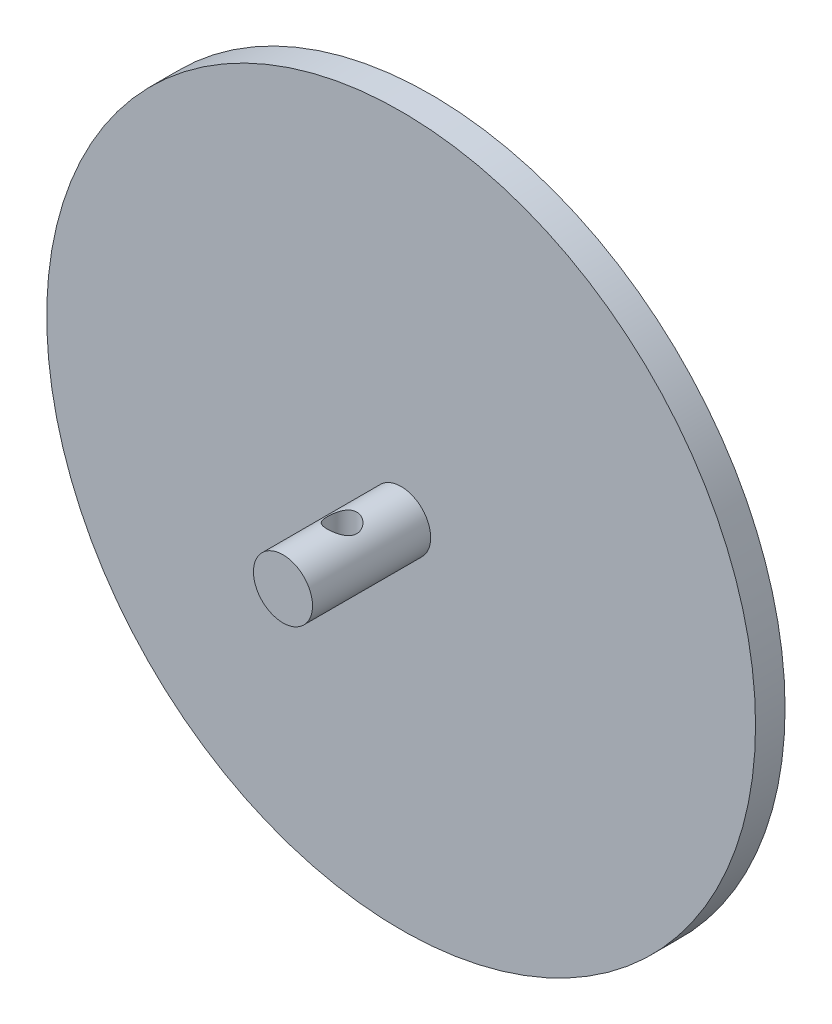
ISO-10303-21;
HEADER;
FILE_DESCRIPTION(('STEP AP214'),'2;1');
FILE_NAME('part.step','',(''),(''),'','','');
FILE_SCHEMA(('AUTOMOTIVE_DESIGN { 1 0 10303 214 1 1 1 1 }'));
ENDSEC;
DATA;
#1=APPLICATION_CONTEXT('core data for automotive mechanical design processes');
#2=APPLICATION_PROTOCOL_DEFINITION('international standard','automotive_design',2000,#1);
#3=PRODUCT_CONTEXT('',#1,'mechanical');
#4=PRODUCT('Part','Part','',(#3));
#5=PRODUCT_RELATED_PRODUCT_CATEGORY('part','',(#4));
#6=PRODUCT_DEFINITION_FORMATION('','',#4);
#7=PRODUCT_DEFINITION_CONTEXT('part definition',#1,'design');
#8=PRODUCT_DEFINITION('design','',#6,#7);
#9=PRODUCT_DEFINITION_SHAPE('','',#8);
#10=(LENGTH_UNIT() NAMED_UNIT(*) SI_UNIT(.MILLI.,.METRE.));
#11=(NAMED_UNIT(*) PLANE_ANGLE_UNIT() SI_UNIT($,.RADIAN.));
#12=(NAMED_UNIT(*) SI_UNIT($,.STERADIAN.) SOLID_ANGLE_UNIT());
#13=UNCERTAINTY_MEASURE_WITH_UNIT(LENGTH_MEASURE(1.E-05),#10,'distance_accuracy_value','');
#14=(GEOMETRIC_REPRESENTATION_CONTEXT(3) GLOBAL_UNCERTAINTY_ASSIGNED_CONTEXT((#13)) GLOBAL_UNIT_ASSIGNED_CONTEXT((#10,
#11,#12)) REPRESENTATION_CONTEXT('',''));
#15=CARTESIAN_POINT('',(0.,0.,0.));
#16=DIRECTION('',(0.,0.,1.));
#17=DIRECTION('',(1.,0.,0.));
#18=AXIS2_PLACEMENT_3D('',#15,#16,#17);
#19=CARTESIAN_POINT('',(0.,0.,25.4));
#20=DIRECTION('',(0.,0.,-1.));
#21=DIRECTION('',(-1.,0.,0.));
#22=AXIS2_PLACEMENT_3D('',#19,#20,#21);
#23=CYLINDRICAL_SURFACE('',#22,6.35);
#24=CARTESIAN_POINT('',(0.,-6.35,15.875));
#25=CARTESIAN_POINT('',(0.0834969220594999,-6.34999931166444,15.8749991122824));
#26=CARTESIAN_POINT('',(0.167002655580042,-6.34834758911701,15.871700125554));
#27=CARTESIAN_POINT('',(0.333378330258781,-6.34179105821715,15.8585541254501));
#28=CARTESIAN_POINT('',(0.416247978955772,-6.33688483467113,15.8487042634742));
#29=CARTESIAN_POINT('',(0.66318203064701,-6.31742426748325,15.809427934954));
#30=CARTESIAN_POINT('',(0.825450146761554,-6.29812827299425,15.7702749225986));
#31=CARTESIAN_POINT('',(1.13965128900426,-6.2489182313574,15.6680092887059));
#32=CARTESIAN_POINT('',(1.29162180811868,-6.21904547786825,15.6049897807566));
#33=CARTESIAN_POINT('',(1.58264035037879,-6.15142812041637,15.4572639263711));
#34=CARTESIAN_POINT('',(1.72168939123018,-6.11368413715877,15.372559289849));
#35=CARTESIAN_POINT('',(1.99234108848171,-6.03111096182982,15.1780303702658));
#36=CARTESIAN_POINT('',(2.12298433900092,-5.98599127270818,15.0669964222061));
#37=CARTESIAN_POINT('',(2.36467069069854,-5.89470535591056,14.8256033164272));
#38=CARTESIAN_POINT('',(2.47569885601321,-5.84853836069043,14.6952295702336));
#39=CARTESIAN_POINT('',(2.68368848497886,-5.75623634934464,14.4065790522467));
#40=CARTESIAN_POINT('',(2.77889135161934,-5.71038146176788,14.2469224686984));
#41=CARTESIAN_POINT('',(2.90019349951534,-5.64919759286363,13.9954520128256));
#42=CARTESIAN_POINT('',(2.93705266116892,-5.63006420805933,13.9095999381713));
#43=CARTESIAN_POINT('',(3.00322508739606,-5.59504604853267,13.7344143862936));
#44=CARTESIAN_POINT('',(3.03254280972159,-5.57915935583429,13.6450830018194));
#45=CARTESIAN_POINT('',(3.08174263292982,-5.55212611635049,13.4689894480353));
#46=CARTESIAN_POINT('',(3.10208128111978,-5.54075429137746,13.3823892059714));
#47=CARTESIAN_POINT('',(3.13545600360765,-5.52193654886444,13.2074127210056));
#48=CARTESIAN_POINT('',(3.14849595237257,-5.51448854851135,13.1190374462283));
#49=CARTESIAN_POINT('',(3.1670771305344,-5.50383875782919,12.9412932611514));
#50=CARTESIAN_POINT('',(3.1726228759965,-5.50063441026522,12.8519249820126));
#51=CARTESIAN_POINT('',(3.17614778806993,-5.49859788398609,12.6730192158219));
#52=CARTESIAN_POINT('',(3.17412767659872,-5.49976528812799,12.5834817457287));
#53=CARTESIAN_POINT('',(3.1581193033026,-5.50899190362733,12.3372521242756));
#54=CARTESIAN_POINT('',(3.13621253452965,-5.52160857357707,12.1811582701866));
#55=CARTESIAN_POINT('',(3.07003746372168,-5.55866493052824,11.8753533586935));
#56=CARTESIAN_POINT('',(3.02576203854504,-5.58310838358077,11.7256443509772));
#57=CARTESIAN_POINT('',(2.91531509833647,-5.64157885407237,11.4324557034359));
#58=CARTESIAN_POINT('',(2.84865758129418,-5.67581583876129,11.2892023900634));
#59=CARTESIAN_POINT('',(2.69570761526054,-5.75003268807633,11.015233913826));
#60=CARTESIAN_POINT('',(2.60940634674629,-5.79001512927804,10.8845244203915));
#61=CARTESIAN_POINT('',(2.40685964249565,-5.87734289018611,10.6218957257497));
#62=CARTESIAN_POINT('',(2.28820488335253,-5.92497898403936,10.4919246151435));
#63=CARTESIAN_POINT('',(2.03058898448427,-6.01813700574905,10.2529148571362));
#64=CARTESIAN_POINT('',(1.89161819563546,-6.06365791538158,10.1438862136413));
#65=CARTESIAN_POINT('',(1.58913989972483,-6.1500381059768,9.94509808028028));
#66=CARTESIAN_POINT('',(1.42479265164788,-6.19058274974572,9.85646851442006));
#67=CARTESIAN_POINT('',(1.08098023585583,-6.25976272299952,9.70884191836465));
#68=CARTESIAN_POINT('',(0.901527205073895,-6.28840750578946,9.64982135886829));
#69=CARTESIAN_POINT('',(0.548533610626832,-6.32854759690358,9.56794059660095));
#70=CARTESIAN_POINT('',(0.375734359385243,-6.34126679122995,9.54249032741266));
#71=CARTESIAN_POINT('',(0.0278752299448298,-6.35231817716325,9.52034947773974));
#72=CARTESIAN_POINT('',(-0.14718353806002,-6.35065718436129,9.52364527286068));
#73=CARTESIAN_POINT('',(-0.480164686080363,-6.33384535408399,9.55740623594539));
#74=CARTESIAN_POINT('',(-0.638363620564191,-6.31975005060431,9.58574579147484));
#75=CARTESIAN_POINT('',(-0.947441883053002,-6.28085393924121,9.6654558782099));
#76=CARTESIAN_POINT('',(-1.09832040207141,-6.25605195113515,9.71682894847729));
#77=CARTESIAN_POINT('',(-1.39347133182512,-6.19709998236334,9.8424951309378));
#78=CARTESIAN_POINT('',(-1.53743151047822,-6.16270299610717,9.91740158411119));
#79=CARTESIAN_POINT('',(-1.8112148234104,-6.08787118465664,10.0873164256859));
#80=CARTESIAN_POINT('',(-1.94103189959928,-6.0474337895468,10.1823333773854));
#81=CARTESIAN_POINT('',(-2.19636241342679,-5.95973602709938,10.4005393503738));
#82=CARTESIAN_POINT('',(-2.3202013468198,-5.91219559251098,10.5255786071116));
#83=CARTESIAN_POINT('',(-2.54589381918874,-5.81858093231368,10.7947623551498));
#84=CARTESIAN_POINT('',(-2.64773214935251,-5.77250773963547,10.9389199523809));
#85=CARTESIAN_POINT('',(-2.83117262876716,-5.68487535288742,11.2510686019584));
#86=CARTESIAN_POINT('',(-2.91155594998014,-5.64364281441821,11.4198757695104));
#87=CARTESIAN_POINT('',(-3.04191297152939,-5.5744767953732,11.7713444648897));
#88=CARTESIAN_POINT('',(-3.0919258549222,-5.54652618900869,11.9539877978474));
#89=CARTESIAN_POINT('',(-3.15551086037918,-5.51057765714603,12.3091899564702));
#90=CARTESIAN_POINT('',(-3.17212027309711,-5.50092192343245,12.4810337504072));
#91=CARTESIAN_POINT('',(-3.17718805563876,-5.49800001145358,12.8252444424952));
#92=CARTESIAN_POINT('',(-3.16565862768386,-5.50472672904441,12.9976110815426));
#93=CARTESIAN_POINT('',(-3.11761548073658,-5.53205211477784,13.3206601030739));
#94=CARTESIAN_POINT('',(-3.08358651207686,-5.55126823076269,13.4718439417311));
#95=CARTESIAN_POINT('',(-2.99458164828807,-5.59977978302582,13.7661908301672));
#96=CARTESIAN_POINT('',(-2.93959901505999,-5.62907846127335,13.9093512828503));
#97=CARTESIAN_POINT('',(-2.8061154442137,-5.69685576337174,14.1942336994285));
#98=CARTESIAN_POINT('',(-2.72628260503929,-5.73581889480533,14.3352128093657));
#99=CARTESIAN_POINT('',(-2.54682759156583,-5.81772207082382,14.6026974317231));
#100=CARTESIAN_POINT('',(-2.44719512169931,-5.8606641782013,14.7291953599427));
#101=CARTESIAN_POINT('',(-2.21680287661219,-5.95192753761203,14.9800975241771));
#102=CARTESIAN_POINT('',(-2.08373188558712,-6.00026839877346,15.1023797564128));
#103=CARTESIAN_POINT('',(-1.79751265125243,-6.0921234557675,15.3233978732331));
#104=CARTESIAN_POINT('',(-1.64435365457428,-6.13563504323043,15.4221210659827));
#105=CARTESIAN_POINT('',(-1.40178715704487,-6.19391073190243,15.5502802661971));
#106=CARTESIAN_POINT('',(-1.31842200030918,-6.21223173271383,15.5898005836814));
#107=CARTESIAN_POINT('',(-1.1480770102167,-6.24595363475604,15.6615994748237));
#108=CARTESIAN_POINT('',(-1.06109897786306,-6.26135597012704,15.6938816065344));
#109=CARTESIAN_POINT('',(-0.884361322813105,-6.28875097111981,15.750759345915));
#110=CARTESIAN_POINT('',(-0.794608244970569,-6.30075106809478,15.7753717181381));
#111=CARTESIAN_POINT('',(-0.612925661591581,-6.32100983571903,15.8166673895299));
#112=CARTESIAN_POINT('',(-0.520997521680289,-6.3292707916836,15.8333555321935));
#113=CARTESIAN_POINT('',(-0.357531347524374,-6.34032503263334,15.8556162848624));
#114=CARTESIAN_POINT('',(-0.286274046488596,-6.34394670812889,15.8628788212496));
#115=CARTESIAN_POINT('',(-0.143346668941347,-6.34878452045567,15.8725711265376));
#116=CARTESIAN_POINT('',(-0.071676581091426,-6.35000059089052,15.8750007620468));
#117=CARTESIAN_POINT('',(0.,-6.35,15.875));
#118=B_SPLINE_CURVE_WITH_KNOTS('',3,(#24,#25,#26,#27,#28,#29,#30,#31,#32,#33,#34,#35,#36,#37,
#38,#39,#40,#41,#42,#43,#44,#45,#46,#47,#48,#49,#50,#51,#52,#53,#54,#55,#56,#57,#58,#59,#60,#61,
#62,#63,#64,#65,#66,#67,#68,#69,#70,#71,#72,#73,#74,#75,#76,#77,#78,#79,#80,#81,#82,#83,#84,#85,
#86,#87,#88,#89,#90,#91,#92,#93,#94,#95,#96,#97,#98,#99,#100,#101,#102,#103,#104,#105,#106,#107,
#108,#109,#110,#111,#112,#113,#114,#115,#116,#117),.UNSPECIFIED.,.T.,.F.,(4,2,2,2,2,2,2,2,2,2,2,
2,2,2,2,2,2,2,2,2,2,2,2,2,2,2,2,2,2,2,2,2,2,2,2,2,2,2,2,2,2,2,2,2,2,2,4),(0.,0.25041561210268,
0.500940186864014,1.00234854488129,1.50182051324263,2.00125310940106,2.53090025348452,
3.06094897410615,3.63210298373098,3.91787290005989,4.20347350732849,4.47213270490103,
4.74064915090148,5.00900371453887,5.27733267302577,5.74927594687739,6.22136960256846,
6.70445970327764,7.18776712794021,7.73235646527881,8.27720530143646,8.84735553323666,
9.41705196489304,9.93956405039339,10.4618285011675,10.9436138594975,11.4254523397102,
11.9210677568139,12.4168946391879,12.9614122158798,13.5063050164601,14.0775857365549,
14.6481278321882,15.1639000911419,15.6794487286237,16.1458838633213,16.6124691169503,
17.1104020806943,17.6085946442304,18.1673210354482,18.7263477502426,19.0082017078365,
19.2899168101042,19.5710117490933,19.8519346536844,20.0668939492148,20.2818591776892),.UNSPECIFIED.);
#119=CARTESIAN_POINT('',(0.,-6.35,15.875));
#120=VERTEX_POINT('',#119);
#121=EDGE_CURVE('E10',#120,#120,#118,.T.);
#122=ORIENTED_EDGE('',*,*,#121,.T.);
#123=EDGE_LOOP('',(#122));
#124=FACE_BOUND('',#123,.T.);
#125=CARTESIAN_POINT('',(0.,6.35,15.875));
#126=CARTESIAN_POINT('',(-0.0834969220594999,6.34999931166444,15.8749991122824));
#127=CARTESIAN_POINT('',(-0.167002655580042,6.34834758911701,15.871700125554));
#128=CARTESIAN_POINT('',(-0.333378330258781,6.34179105821715,15.8585541254501));
#129=CARTESIAN_POINT('',(-0.416247978955772,6.33688483467113,15.8487042634742));
#130=CARTESIAN_POINT('',(-0.66318203064701,6.31742426748325,15.809427934954));
#131=CARTESIAN_POINT('',(-0.825450146761554,6.29812827299425,15.7702749225986));
#132=CARTESIAN_POINT('',(-1.13965128900426,6.2489182313574,15.6680092887059));
#133=CARTESIAN_POINT('',(-1.29162180811868,6.21904547786825,15.6049897807566));
#134=CARTESIAN_POINT('',(-1.58264035037879,6.15142812041637,15.4572639263711));
#135=CARTESIAN_POINT('',(-1.72168939123018,6.11368413715877,15.372559289849));
#136=CARTESIAN_POINT('',(-1.99234108848171,6.03111096182982,15.1780303702658));
#137=CARTESIAN_POINT('',(-2.12298433900092,5.98599127270818,15.0669964222061));
#138=CARTESIAN_POINT('',(-2.36467069069854,5.89470535591056,14.8256033164272));
#139=CARTESIAN_POINT('',(-2.47569885601321,5.84853836069043,14.6952295702336));
#140=CARTESIAN_POINT('',(-2.68368848497886,5.75623634934464,14.4065790522467));
#141=CARTESIAN_POINT('',(-2.77889135161934,5.71038146176788,14.2469224686984));
#142=CARTESIAN_POINT('',(-2.90019349951534,5.64919759286363,13.9954520128256));
#143=CARTESIAN_POINT('',(-2.93705266116892,5.63006420805933,13.9095999381713));
#144=CARTESIAN_POINT('',(-3.00322508739606,5.59504604853267,13.7344143862936));
#145=CARTESIAN_POINT('',(-3.03254280972159,5.57915935583429,13.6450830018194));
#146=CARTESIAN_POINT('',(-3.08174263292982,5.55212611635049,13.4689894480353));
#147=CARTESIAN_POINT('',(-3.10208128111978,5.54075429137746,13.3823892059714));
#148=CARTESIAN_POINT('',(-3.13545600360765,5.52193654886444,13.2074127210056));
#149=CARTESIAN_POINT('',(-3.14849595237257,5.51448854851135,13.1190374462283));
#150=CARTESIAN_POINT('',(-3.1670771305344,5.50383875782919,12.9412932611514));
#151=CARTESIAN_POINT('',(-3.1726228759965,5.50063441026522,12.8519249820126));
#152=CARTESIAN_POINT('',(-3.17614778806993,5.49859788398609,12.6730192158219));
#153=CARTESIAN_POINT('',(-3.17412767659872,5.49976528812799,12.5834817457287));
#154=CARTESIAN_POINT('',(-3.1581193033026,5.50899190362733,12.3372521242756));
#155=CARTESIAN_POINT('',(-3.13621253452965,5.52160857357707,12.1811582701866));
#156=CARTESIAN_POINT('',(-3.07003746372168,5.55866493052824,11.8753533586935));
#157=CARTESIAN_POINT('',(-3.02576203854504,5.58310838358077,11.7256443509772));
#158=CARTESIAN_POINT('',(-2.91531509833647,5.64157885407237,11.4324557034359));
#159=CARTESIAN_POINT('',(-2.84865758129418,5.67581583876129,11.2892023900634));
#160=CARTESIAN_POINT('',(-2.69570761526054,5.75003268807633,11.015233913826));
#161=CARTESIAN_POINT('',(-2.60940634674629,5.79001512927804,10.8845244203915));
#162=CARTESIAN_POINT('',(-2.40685964249565,5.87734289018611,10.6218957257497));
#163=CARTESIAN_POINT('',(-2.28820488335253,5.92497898403936,10.4919246151435));
#164=CARTESIAN_POINT('',(-2.03058898448427,6.01813700574905,10.2529148571362));
#165=CARTESIAN_POINT('',(-1.89161819563546,6.06365791538158,10.1438862136413));
#166=CARTESIAN_POINT('',(-1.58913989972483,6.1500381059768,9.94509808028028));
#167=CARTESIAN_POINT('',(-1.42479265164788,6.19058274974572,9.85646851442006));
#168=CARTESIAN_POINT('',(-1.08098023585583,6.25976272299952,9.70884191836465));
#169=CARTESIAN_POINT('',(-0.901527205073895,6.28840750578946,9.64982135886829));
#170=CARTESIAN_POINT('',(-0.548533610626832,6.32854759690358,9.56794059660095));
#171=CARTESIAN_POINT('',(-0.375734359385243,6.34126679122995,9.54249032741266));
#172=CARTESIAN_POINT('',(-0.0278752299448298,6.35231817716325,9.52034947773974));
#173=CARTESIAN_POINT('',(0.14718353806002,6.35065718436129,9.52364527286068));
#174=CARTESIAN_POINT('',(0.480164686080363,6.33384535408399,9.55740623594539));
#175=CARTESIAN_POINT('',(0.638363620564191,6.31975005060431,9.58574579147484));
#176=CARTESIAN_POINT('',(0.947441883053002,6.28085393924121,9.6654558782099));
#177=CARTESIAN_POINT('',(1.09832040207141,6.25605195113515,9.71682894847729));
#178=CARTESIAN_POINT('',(1.39347133182512,6.19709998236334,9.8424951309378));
#179=CARTESIAN_POINT('',(1.53743151047822,6.16270299610717,9.91740158411119));
#180=CARTESIAN_POINT('',(1.8112148234104,6.08787118465664,10.0873164256859));
#181=CARTESIAN_POINT('',(1.94103189959928,6.0474337895468,10.1823333773854));
#182=CARTESIAN_POINT('',(2.19636241342679,5.95973602709938,10.4005393503738));
#183=CARTESIAN_POINT('',(2.3202013468198,5.91219559251098,10.5255786071116));
#184=CARTESIAN_POINT('',(2.54589381918874,5.81858093231368,10.7947623551498));
#185=CARTESIAN_POINT('',(2.64773214935251,5.77250773963547,10.9389199523809));
#186=CARTESIAN_POINT('',(2.83117262876716,5.68487535288742,11.2510686019584));
#187=CARTESIAN_POINT('',(2.91155594998014,5.64364281441821,11.4198757695104));
#188=CARTESIAN_POINT('',(3.04191297152939,5.5744767953732,11.7713444648897));
#189=CARTESIAN_POINT('',(3.0919258549222,5.54652618900869,11.9539877978474));
#190=CARTESIAN_POINT('',(3.15551086037918,5.51057765714603,12.3091899564702));
#191=CARTESIAN_POINT('',(3.17212027309711,5.50092192343245,12.4810337504072));
#192=CARTESIAN_POINT('',(3.17718805563876,5.49800001145358,12.8252444424952));
#193=CARTESIAN_POINT('',(3.16565862768386,5.50472672904441,12.9976110815426));
#194=CARTESIAN_POINT('',(3.11761548073658,5.53205211477784,13.3206601030739));
#195=CARTESIAN_POINT('',(3.08358651207686,5.55126823076269,13.4718439417311));
#196=CARTESIAN_POINT('',(2.99458164828807,5.59977978302582,13.7661908301672));
#197=CARTESIAN_POINT('',(2.93959901505999,5.62907846127335,13.9093512828503));
#198=CARTESIAN_POINT('',(2.8061154442137,5.69685576337174,14.1942336994285));
#199=CARTESIAN_POINT('',(2.72628260503929,5.73581889480533,14.3352128093657));
#200=CARTESIAN_POINT('',(2.54682759156583,5.81772207082382,14.6026974317231));
#201=CARTESIAN_POINT('',(2.44719512169931,5.8606641782013,14.7291953599427));
#202=CARTESIAN_POINT('',(2.21680287661219,5.95192753761203,14.9800975241771));
#203=CARTESIAN_POINT('',(2.08373188558712,6.00026839877346,15.1023797564128));
#204=CARTESIAN_POINT('',(1.79751265125243,6.0921234557675,15.3233978732331));
#205=CARTESIAN_POINT('',(1.64435365457428,6.13563504323043,15.4221210659827));
#206=CARTESIAN_POINT('',(1.40178715704487,6.19391073190243,15.5502802661971));
#207=CARTESIAN_POINT('',(1.31842200030918,6.21223173271383,15.5898005836814));
#208=CARTESIAN_POINT('',(1.1480770102167,6.24595363475604,15.6615994748237));
#209=CARTESIAN_POINT('',(1.06109897786306,6.26135597012704,15.6938816065344));
#210=CARTESIAN_POINT('',(0.884361322813105,6.28875097111981,15.750759345915));
#211=CARTESIAN_POINT('',(0.794608244970569,6.30075106809478,15.7753717181381));
#212=CARTESIAN_POINT('',(0.612925661591581,6.32100983571903,15.8166673895299));
#213=CARTESIAN_POINT('',(0.520997521680289,6.3292707916836,15.8333555321935));
#214=CARTESIAN_POINT('',(0.357531347524374,6.34032503263334,15.8556162848624));
#215=CARTESIAN_POINT('',(0.286274046488596,6.34394670812889,15.8628788212496));
#216=CARTESIAN_POINT('',(0.143346668941347,6.34878452045567,15.8725711265376));
#217=CARTESIAN_POINT('',(0.071676581091426,6.35000059089052,15.8750007620468));
#218=CARTESIAN_POINT('',(0.,6.35,15.875));
#219=B_SPLINE_CURVE_WITH_KNOTS('',3,(#125,#126,#127,#128,#129,#130,#131,#132,#133,#134,#135,
#136,#137,#138,#139,#140,#141,#142,#143,#144,#145,#146,#147,#148,#149,#150,#151,#152,#153,#154,
#155,#156,#157,#158,#159,#160,#161,#162,#163,#164,#165,#166,#167,#168,#169,#170,#171,#172,#173,
#174,#175,#176,#177,#178,#179,#180,#181,#182,#183,#184,#185,#186,#187,#188,#189,#190,#191,#192,
#193,#194,#195,#196,#197,#198,#199,#200,#201,#202,#203,#204,#205,#206,#207,#208,#209,#210,#211,
#212,#213,#214,#215,#216,#217,#218),.UNSPECIFIED.,.T.,.F.,(4,2,2,2,2,2,2,2,2,2,2,2,2,2,2,2,2,2,
2,2,2,2,2,2,2,2,2,2,2,2,2,2,2,2,2,2,2,2,2,2,2,2,2,2,2,2,4),(0.,0.25041561210268,
0.500940186864014,1.00234854488129,1.50182051324263,2.00125310940106,2.53090025348452,
3.06094897410615,3.63210298373098,3.91787290005989,4.20347350732849,4.47213270490103,
4.74064915090148,5.00900371453887,5.27733267302577,5.74927594687739,6.22136960256846,
6.70445970327764,7.18776712794021,7.73235646527881,8.27720530143646,8.84735553323666,
9.41705196489304,9.93956405039339,10.4618285011675,10.9436138594975,11.4254523397102,
11.9210677568139,12.4168946391879,12.9614122158798,13.5063050164601,14.0775857365549,
14.6481278321882,15.1639000911419,15.6794487286237,16.1458838633213,16.6124691169503,
17.1104020806943,17.6085946442304,18.1673210354482,18.7263477502426,19.0082017078365,
19.2899168101042,19.5710117490933,19.8519346536844,20.0668939492148,20.2818591776892),.UNSPECIFIED.);
#220=CARTESIAN_POINT('',(0.,6.35,15.875));
#221=VERTEX_POINT('',#220);
#222=EDGE_CURVE('E44',#221,#221,#219,.T.);
#223=ORIENTED_EDGE('',*,*,#222,.T.);
#224=EDGE_LOOP('',(#223));
#225=FACE_BOUND('',#224,.T.);
#226=CARTESIAN_POINT('',(0.,0.,25.4));
#227=DIRECTION('',(0.,0.,1.));
#228=DIRECTION('',(1.,0.,0.));
#229=AXIS2_PLACEMENT_3D('',#226,#227,#228);
#230=CIRCLE('',#229,6.35);
#231=CARTESIAN_POINT('',(6.35,0.,25.4));
#232=VERTEX_POINT('',#231);
#233=EDGE_CURVE('E48',#232,#232,#230,.T.);
#234=ORIENTED_EDGE('',*,*,#233,.F.);
#235=EDGE_LOOP('',(#234));
#236=FACE_BOUND('',#235,.T.);
#237=CARTESIAN_POINT('',(0.,0.,0.));
#238=DIRECTION('',(0.,0.,-1.));
#239=DIRECTION('',(-1.,0.,0.));
#240=AXIS2_PLACEMENT_3D('',#237,#238,#239);
#241=CIRCLE('',#240,6.35);
#242=CARTESIAN_POINT('',(-6.35,0.,0.));
#243=VERTEX_POINT('',#242);
#244=EDGE_CURVE('E52',#243,#243,#241,.T.);
#245=ORIENTED_EDGE('',*,*,#244,.F.);
#246=EDGE_LOOP('',(#245));
#247=FACE_BOUND('',#246,.T.);
#248=ADVANCED_FACE('F34',(#124,#225,#236,#247),#23,.T.);
#249=CARTESIAN_POINT('',(0.,0.,25.4));
#250=DIRECTION('',(0.,0.,1.));
#251=DIRECTION('',(1.,0.,0.));
#252=AXIS2_PLACEMENT_3D('',#249,#250,#251);
#253=PLANE('',#252);
#254=ORIENTED_EDGE('',*,*,#233,.T.);
#255=EDGE_LOOP('',(#254));
#256=FACE_BOUND('',#255,.T.);
#257=ADVANCED_FACE('F62',(#256),#253,.T.);
#258=CARTESIAN_POINT('',(0.,-6.35,12.7));
#259=DIRECTION('',(0.,1.,0.));
#260=DIRECTION('',(0.,0.,1.));
#261=AXIS2_PLACEMENT_3D('',#258,#259,#260);
#262=CYLINDRICAL_SURFACE('',#261,3.175);
#263=ORIENTED_EDGE('',*,*,#222,.F.);
#264=EDGE_LOOP('',(#263));
#265=FACE_BOUND('',#264,.T.);
#266=ORIENTED_EDGE('',*,*,#121,.F.);
#267=EDGE_LOOP('',(#266));
#268=FACE_BOUND('',#267,.T.);
#269=ADVANCED_FACE('F57',(#265,#268),#262,.F.);
#270=CARTESIAN_POINT('',(-2.4980018054066E-13,0.,-773.112499999997));
#271=DIRECTION('',(0.,0.,1.));
#272=DIRECTION('',(-1.,0.,0.));
#273=AXIS2_PLACEMENT_3D('',#270,#271,#272);
#274=SPHERICAL_SURFACE('',#273,769.937499999997);
#275=CARTESIAN_POINT('',(0.,0.,-6.34999999999998));
#276=DIRECTION('',(0.,0.,1.));
#277=DIRECTION('',(1.,0.,0.));
#278=AXIS2_PLACEMENT_3D('',#275,#276,#277);
#279=CIRCLE('',#278,69.85);
#280=CARTESIAN_POINT('',(69.85,0.,-6.34999999999998));
#281=VERTEX_POINT('',#280);
#282=EDGE_CURVE('E77',#281,#281,#279,.T.);
#283=ORIENTED_EDGE('',*,*,#282,.F.);
#284=EDGE_LOOP('',(#283));
#285=FACE_BOUND('',#284,.T.);
#286=ADVANCED_FACE('F61',(#285),#274,.F.);
#287=CARTESIAN_POINT('',(-69.85,0.,-6.34999999999998));
#288=DIRECTION('',(0.,0.,1.));
#289=DIRECTION('',(1.,0.,0.));
#290=AXIS2_PLACEMENT_3D('',#287,#288,#289);
#291=PLANE('',#290);
#292=CARTESIAN_POINT('',(0.,0.,-6.34999999999998));
#293=DIRECTION('',(0.,0.,1.));
#294=DIRECTION('',(1.,0.,0.));
#295=AXIS2_PLACEMENT_3D('',#292,#293,#294);
#296=CIRCLE('',#295,76.2);
#297=CARTESIAN_POINT('',(76.2,0.,-6.34999999999998));
#298=VERTEX_POINT('',#297);
#299=EDGE_CURVE('E79',#298,#298,#296,.T.);
#300=ORIENTED_EDGE('',*,*,#299,.F.);
#301=EDGE_LOOP('',(#300));
#302=FACE_BOUND('',#301,.T.);
#303=ORIENTED_EDGE('',*,*,#282,.T.);
#304=EDGE_LOOP('',(#303));
#305=FACE_BOUND('',#304,.T.);
#306=ADVANCED_FACE('F93',(#302,#305),#291,.F.);
#307=CARTESIAN_POINT('',(0.,0.,50.));
#308=DIRECTION('',(0.,0.,1.));
#309=DIRECTION('',(1.,0.,0.));
#310=AXIS2_PLACEMENT_3D('',#307,#308,#309);
#311=CYLINDRICAL_SURFACE('',#310,76.2);
#312=CARTESIAN_POINT('',(0.,0.,0.));
#313=DIRECTION('',(0.,0.,1.));
#314=DIRECTION('',(1.,0.,0.));
#315=AXIS2_PLACEMENT_3D('',#312,#313,#314);
#316=CIRCLE('',#315,76.2);
#317=CARTESIAN_POINT('',(76.2,0.,0.));
#318=VERTEX_POINT('',#317);
#319=EDGE_CURVE('E84',#318,#318,#316,.T.);
#320=ORIENTED_EDGE('',*,*,#319,.F.);
#321=EDGE_LOOP('',(#320));
#322=FACE_BOUND('',#321,.T.);
#323=ORIENTED_EDGE('',*,*,#299,.T.);
#324=EDGE_LOOP('',(#323));
#325=FACE_BOUND('',#324,.T.);
#326=ADVANCED_FACE('F90',(#322,#325),#311,.T.);
#327=CARTESIAN_POINT('',(-76.2,0.,0.));
#328=DIRECTION('',(0.,0.,-1.));
#329=DIRECTION('',(-1.,0.,0.));
#330=AXIS2_PLACEMENT_3D('',#327,#328,#329);
#331=PLANE('',#330);
#332=ORIENTED_EDGE('',*,*,#244,.T.);
#333=EDGE_LOOP('',(#332));
#334=FACE_BOUND('',#333,.T.);
#335=ORIENTED_EDGE('',*,*,#319,.T.);
#336=EDGE_LOOP('',(#335));
#337=FACE_BOUND('',#336,.T.);
#338=ADVANCED_FACE('F88',(#334,#337),#331,.F.);
#339=CLOSED_SHELL('',(#248,#257,#269,#286,#306,#326,#338));
#340=MANIFOLD_SOLID_BREP('B2',#339);
#341=ADVANCED_BREP_SHAPE_REPRESENTATION('',(#18,#340),#14);
#342=SHAPE_DEFINITION_REPRESENTATION(#9,#341);
ENDSEC;
END-ISO-10303-21;
